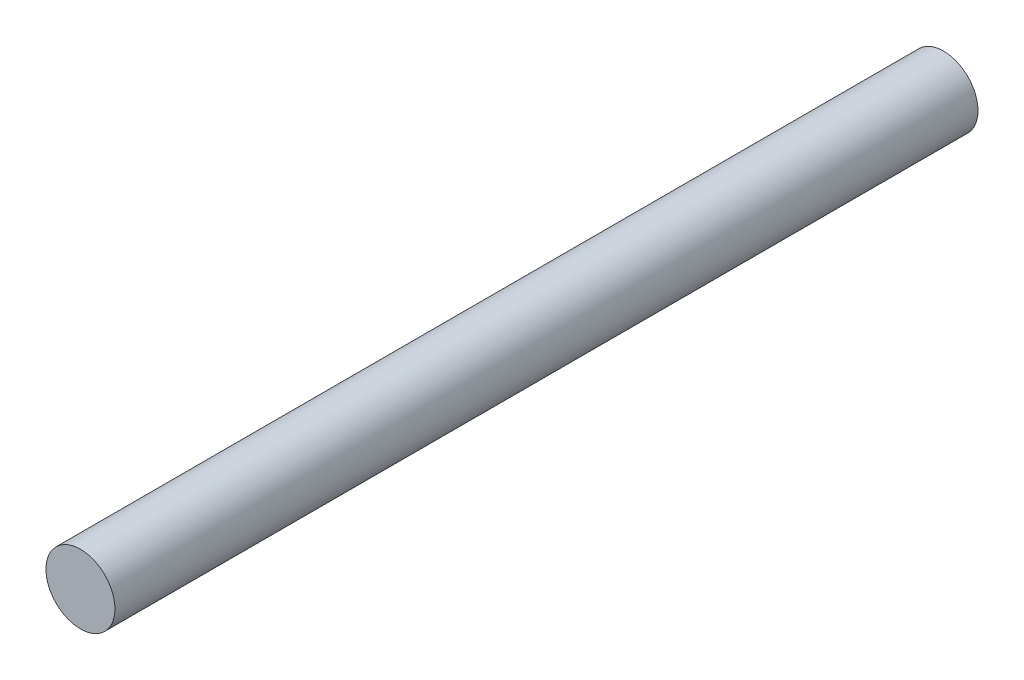
ISO-10303-21;
HEADER;
FILE_DESCRIPTION(('STEP AP214'),'2;1');
FILE_NAME('part.step','',(''),(''),'','','');
FILE_SCHEMA(('AUTOMOTIVE_DESIGN { 1 0 10303 214 1 1 1 1 }'));
ENDSEC;
DATA;
#1=APPLICATION_CONTEXT('core data for automotive mechanical design processes');
#2=APPLICATION_PROTOCOL_DEFINITION('international standard','automotive_design',2000,#1);
#3=PRODUCT_CONTEXT('',#1,'mechanical');
#4=PRODUCT('Part','Part','',(#3));
#5=PRODUCT_RELATED_PRODUCT_CATEGORY('part','',(#4));
#6=PRODUCT_DEFINITION_FORMATION('','',#4);
#7=PRODUCT_DEFINITION_CONTEXT('part definition',#1,'design');
#8=PRODUCT_DEFINITION('design','',#6,#7);
#9=PRODUCT_DEFINITION_SHAPE('','',#8);
#10=(LENGTH_UNIT() NAMED_UNIT(*) SI_UNIT(.MILLI.,.METRE.));
#11=(NAMED_UNIT(*) PLANE_ANGLE_UNIT() SI_UNIT($,.RADIAN.));
#12=(NAMED_UNIT(*) SI_UNIT($,.STERADIAN.) SOLID_ANGLE_UNIT());
#13=UNCERTAINTY_MEASURE_WITH_UNIT(LENGTH_MEASURE(1.E-05),#10,'distance_accuracy_value','');
#14=(GEOMETRIC_REPRESENTATION_CONTEXT(3) GLOBAL_UNCERTAINTY_ASSIGNED_CONTEXT((#13)) GLOBAL_UNIT_ASSIGNED_CONTEXT((#10,
#11,#12)) REPRESENTATION_CONTEXT('',''));
#15=CARTESIAN_POINT('',(0.,0.,0.));
#16=DIRECTION('',(0.,0.,1.));
#17=DIRECTION('',(1.,0.,0.));
#18=AXIS2_PLACEMENT_3D('',#15,#16,#17);
#19=CARTESIAN_POINT('',(0.,0.,625.));
#20=DIRECTION('',(0.,0.,-1.));
#21=DIRECTION('',(-1.,0.,0.));
#22=AXIS2_PLACEMENT_3D('',#19,#20,#21);
#23=CYLINDRICAL_SURFACE('',#22,25.);
#24=CARTESIAN_POINT('',(0.,0.,625.));
#25=DIRECTION('',(0.,0.,1.));
#26=DIRECTION('',(1.,0.,0.));
#27=AXIS2_PLACEMENT_3D('',#24,#25,#26);
#28=CIRCLE('',#27,25.);
#29=CARTESIAN_POINT('',(25.,0.,625.));
#30=VERTEX_POINT('',#29);
#31=EDGE_CURVE('E10',#30,#30,#28,.T.);
#32=ORIENTED_EDGE('',*,*,#31,.F.);
#33=EDGE_LOOP('',(#32));
#34=FACE_BOUND('',#33,.T.);
#35=CARTESIAN_POINT('',(0.,0.,0.));
#36=DIRECTION('',(0.,0.,1.));
#37=DIRECTION('',(1.,0.,0.));
#38=AXIS2_PLACEMENT_3D('',#35,#36,#37);
#39=CIRCLE('',#38,25.);
#40=CARTESIAN_POINT('',(25.,0.,0.));
#41=VERTEX_POINT('',#40);
#42=EDGE_CURVE('E34',#41,#41,#39,.T.);
#43=ORIENTED_EDGE('',*,*,#42,.T.);
#44=EDGE_LOOP('',(#43));
#45=FACE_BOUND('',#44,.T.);
#46=ADVANCED_FACE('F31',(#34,#45),#23,.T.);
#47=CARTESIAN_POINT('',(0.,0.,625.));
#48=DIRECTION('',(0.,0.,1.));
#49=DIRECTION('',(1.,0.,0.));
#50=AXIS2_PLACEMENT_3D('',#47,#48,#49);
#51=PLANE('',#50);
#52=ORIENTED_EDGE('',*,*,#31,.T.);
#53=EDGE_LOOP('',(#52));
#54=FACE_BOUND('',#53,.T.);
#55=ADVANCED_FACE('F46',(#54),#51,.T.);
#56=CARTESIAN_POINT('',(0.,0.,0.));
#57=DIRECTION('',(0.,0.,1.));
#58=DIRECTION('',(1.,0.,0.));
#59=AXIS2_PLACEMENT_3D('',#56,#57,#58);
#60=PLANE('',#59);
#61=ORIENTED_EDGE('',*,*,#42,.F.);
#62=EDGE_LOOP('',(#61));
#63=FACE_BOUND('',#62,.T.);
#64=ADVANCED_FACE('F44',(#63),#60,.F.);
#65=CLOSED_SHELL('',(#46,#55,#64));
#66=MANIFOLD_SOLID_BREP('B2',#65);
#67=ADVANCED_BREP_SHAPE_REPRESENTATION('',(#18,#66),#14);
#68=SHAPE_DEFINITION_REPRESENTATION(#9,#67);
ENDSEC;
END-ISO-10303-21;
